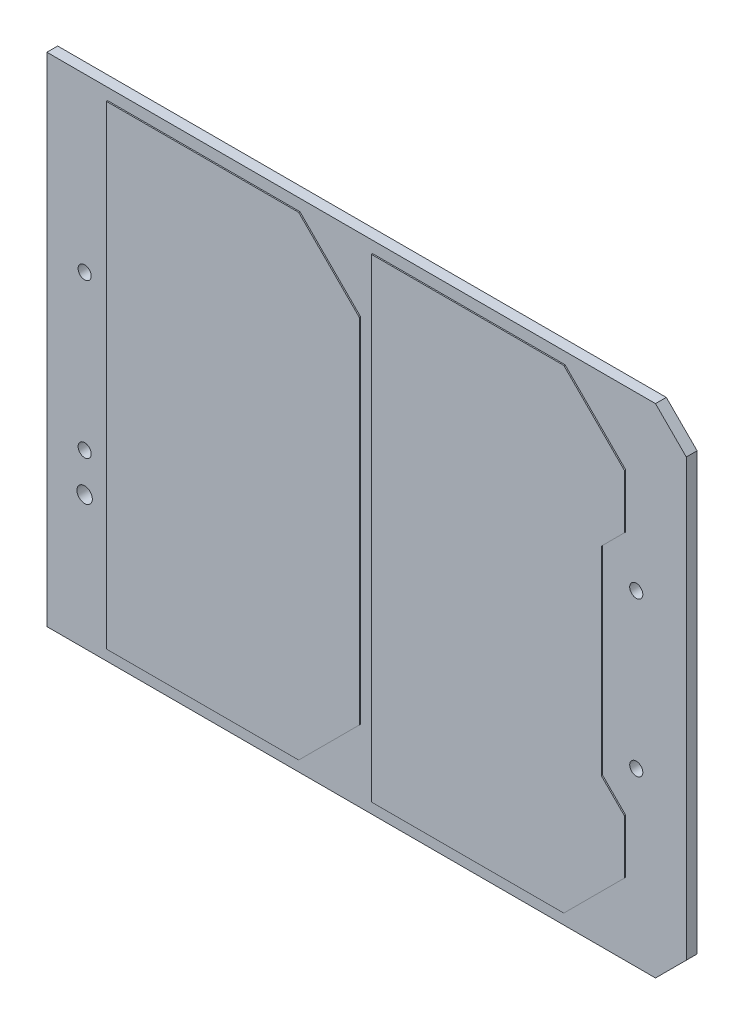
ISO-10303-21;
HEADER;
FILE_DESCRIPTION(('STEP AP214'),'2;1');
FILE_NAME('part.step','',(''),(''),'','','');
FILE_SCHEMA(('AUTOMOTIVE_DESIGN { 1 0 10303 214 1 1 1 1 }'));
ENDSEC;
DATA;
#1=APPLICATION_CONTEXT('core data for automotive mechanical design processes');
#2=APPLICATION_PROTOCOL_DEFINITION('international standard','automotive_design',2000,#1);
#3=PRODUCT_CONTEXT('',#1,'mechanical');
#4=PRODUCT('Part','Part','',(#3));
#5=PRODUCT_RELATED_PRODUCT_CATEGORY('part','',(#4));
#6=PRODUCT_DEFINITION_FORMATION('','',#4);
#7=PRODUCT_DEFINITION_CONTEXT('part definition',#1,'design');
#8=PRODUCT_DEFINITION('design','',#6,#7);
#9=PRODUCT_DEFINITION_SHAPE('','',#8);
#10=(LENGTH_UNIT() NAMED_UNIT(*) SI_UNIT(.MILLI.,.METRE.));
#11=(NAMED_UNIT(*) PLANE_ANGLE_UNIT() SI_UNIT($,.RADIAN.));
#12=(NAMED_UNIT(*) SI_UNIT($,.STERADIAN.) SOLID_ANGLE_UNIT());
#13=UNCERTAINTY_MEASURE_WITH_UNIT(LENGTH_MEASURE(1.E-05),#10,'distance_accuracy_value','');
#14=(GEOMETRIC_REPRESENTATION_CONTEXT(3) GLOBAL_UNCERTAINTY_ASSIGNED_CONTEXT((#13)) GLOBAL_UNIT_ASSIGNED_CONTEXT((#10,
#11,#12)) REPRESENTATION_CONTEXT('',''));
#15=CARTESIAN_POINT('',(0.,0.,0.));
#16=DIRECTION('',(0.,0.,1.));
#17=DIRECTION('',(1.,0.,0.));
#18=AXIS2_PLACEMENT_3D('',#15,#16,#17);
#19=CARTESIAN_POINT('',(0.,0.,1.778));
#20=DIRECTION('',(0.,0.,1.));
#21=DIRECTION('',(1.,0.,0.));
#22=AXIS2_PLACEMENT_3D('',#19,#20,#21);
#23=PLANE('',#22);
#24=CARTESIAN_POINT('',(-46.482,-19.05,1.778));
#25=DIRECTION('',(0.,0.,1.));
#26=DIRECTION('',(1.,0.,0.));
#27=AXIS2_PLACEMENT_3D('',#24,#25,#26);
#28=CIRCLE('',#27,1.27);
#29=CARTESIAN_POINT('',(-45.212,-19.05,1.778));
#30=VERTEX_POINT('',#29);
#31=EDGE_CURVE('E296',#30,#30,#28,.T.);
#32=ORIENTED_EDGE('',*,*,#31,.F.);
#33=EDGE_LOOP('',(#32));
#34=FACE_BOUND('',#33,.T.);
#35=CARTESIAN_POINT('',(-46.482,-12.7,1.778));
#36=DIRECTION('',(0.,0.,1.));
#37=DIRECTION('',(1.,0.,0.));
#38=AXIS2_PLACEMENT_3D('',#35,#36,#37);
#39=CIRCLE('',#38,1.0795);
#40=CARTESIAN_POINT('',(-45.4025,-12.7,1.778));
#41=VERTEX_POINT('',#40);
#42=EDGE_CURVE('E300',#41,#41,#39,.T.);
#43=ORIENTED_EDGE('',*,*,#42,.F.);
#44=EDGE_LOOP('',(#43));
#45=FACE_BOUND('',#44,.T.);
#46=CARTESIAN_POINT('',(-46.482,12.7,1.778));
#47=DIRECTION('',(0.,0.,1.));
#48=DIRECTION('',(1.,0.,0.));
#49=AXIS2_PLACEMENT_3D('',#46,#47,#48);
#50=CIRCLE('',#49,1.0795);
#51=CARTESIAN_POINT('',(-45.4025,12.7,1.778));
#52=VERTEX_POINT('',#51);
#53=EDGE_CURVE('E305',#52,#52,#50,.T.);
#54=ORIENTED_EDGE('',*,*,#53,.F.);
#55=EDGE_LOOP('',(#54));
#56=FACE_BOUND('',#55,.T.);
#57=CARTESIAN_POINT('',(44.45,-12.7,1.778));
#58=DIRECTION('',(0.,0.,1.));
#59=DIRECTION('',(1.,0.,0.));
#60=AXIS2_PLACEMENT_3D('',#57,#58,#59);
#61=CIRCLE('',#60,1.0795);
#62=CARTESIAN_POINT('',(45.5295,-12.7,1.778));
#63=VERTEX_POINT('',#62);
#64=EDGE_CURVE('E309',#63,#63,#61,.T.);
#65=ORIENTED_EDGE('',*,*,#64,.F.);
#66=EDGE_LOOP('',(#65));
#67=FACE_BOUND('',#66,.T.);
#68=CARTESIAN_POINT('',(44.45,12.7,1.778));
#69=DIRECTION('',(0.,0.,1.));
#70=DIRECTION('',(1.,0.,0.));
#71=AXIS2_PLACEMENT_3D('',#68,#69,#70);
#72=CIRCLE('',#71,1.0795);
#73=CARTESIAN_POINT('',(45.5295,12.7,1.778));
#74=VERTEX_POINT('',#73);
#75=EDGE_CURVE('E313',#74,#74,#72,.T.);
#76=ORIENTED_EDGE('',*,*,#75,.F.);
#77=EDGE_LOOP('',(#76));
#78=FACE_BOUND('',#77,.T.);
#79=DIRECTION('',(1.,0.,0.));
#80=VECTOR('',#79,1.);
#81=CARTESIAN_POINT('',(0.,-41.,1.778));
#82=LINE('',#81,#80);
#83=CARTESIAN_POINT('',(-52.705,-41.,1.778));
#84=VERTEX_POINT('',#83);
#85=CARTESIAN_POINT('',(47.625,-41.,1.778));
#86=VERTEX_POINT('',#85);
#87=EDGE_CURVE('E317',#84,#86,#82,.T.);
#88=ORIENTED_EDGE('',*,*,#87,.T.);
#89=DIRECTION('',(-0.707106781186549,-0.707106781186546,0.));
#90=VECTOR('',#89,1.);
#91=CARTESIAN_POINT('',(44.3124999999999,-44.3125000000001,1.778));
#92=LINE('',#91,#90);
#93=CARTESIAN_POINT('',(52.705,-35.92,1.778));
#94=VERTEX_POINT('',#93);
#95=EDGE_CURVE('E55',#86,#94,#92,.F.);
#96=ORIENTED_EDGE('',*,*,#95,.T.);
#97=DIRECTION('',(0.,1.,0.));
#98=VECTOR('',#97,1.);
#99=CARTESIAN_POINT('',(52.705,0.,1.778));
#100=LINE('',#99,#98);
#101=CARTESIAN_POINT('',(52.705,35.92,1.778));
#102=VERTEX_POINT('',#101);
#103=EDGE_CURVE('E320',#94,#102,#100,.T.);
#104=ORIENTED_EDGE('',*,*,#103,.T.);
#105=DIRECTION('',(-0.707106781186546,0.707106781186549,0.));
#106=VECTOR('',#105,1.);
#107=CARTESIAN_POINT('',(44.3125000000001,44.3124999999999,1.778));
#108=LINE('',#107,#106);
#109=CARTESIAN_POINT('',(47.625,41.,1.778));
#110=VERTEX_POINT('',#109);
#111=EDGE_CURVE('E62',#102,#110,#108,.T.);
#112=ORIENTED_EDGE('',*,*,#111,.T.);
#113=DIRECTION('',(1.,0.,0.));
#114=VECTOR('',#113,1.);
#115=CARTESIAN_POINT('',(0.,41.,1.778));
#116=LINE('',#115,#114);
#117=CARTESIAN_POINT('',(-52.705,41.,1.778));
#118=VERTEX_POINT('',#117);
#119=EDGE_CURVE('E323',#118,#110,#116,.T.);
#120=ORIENTED_EDGE('',*,*,#119,.F.);
#121=DIRECTION('',(0.,1.,0.));
#122=VECTOR('',#121,1.);
#123=CARTESIAN_POINT('',(-52.705,0.,1.778));
#124=LINE('',#123,#122);
#125=EDGE_CURVE('E326',#84,#118,#124,.T.);
#126=ORIENTED_EDGE('',*,*,#125,.F.);
#127=EDGE_LOOP('',(#88,#96,#104,#112,#120,#126));
#128=FACE_BOUND('',#127,.T.);
#129=DIRECTION('',(1.,0.,0.));
#130=VECTOR('',#129,1.);
#131=CARTESIAN_POINT('',(-42.705,-39.095,1.778));
#132=LINE('',#131,#130);
#133=CARTESIAN_POINT('',(-42.705,-39.095,1.778));
#134=VERTEX_POINT('',#133);
#135=CARTESIAN_POINT('',(-11.,-39.095,1.778));
#136=VERTEX_POINT('',#135);
#137=EDGE_CURVE('E233',#134,#136,#132,.T.);
#138=ORIENTED_EDGE('',*,*,#137,.F.);
#139=DIRECTION('',(0.,-1.,0.));
#140=VECTOR('',#139,1.);
#141=CARTESIAN_POINT('',(-42.705,39.095,1.778));
#142=LINE('',#141,#140);
#143=CARTESIAN_POINT('',(-42.705,39.095,1.778));
#144=VERTEX_POINT('',#143);
#145=EDGE_CURVE('E228',#144,#134,#142,.T.);
#146=ORIENTED_EDGE('',*,*,#145,.F.);
#147=DIRECTION('',(-1.,0.,0.));
#148=VECTOR('',#147,1.);
#149=CARTESIAN_POINT('',(-42.705,39.095,1.778));
#150=LINE('',#149,#148);
#151=CARTESIAN_POINT('',(-11.,39.095,1.778));
#152=VERTEX_POINT('',#151);
#153=EDGE_CURVE('E244',#152,#144,#150,.T.);
#154=ORIENTED_EDGE('',*,*,#153,.F.);
#155=DIRECTION('',(-0.707106781186547,0.707106781186548,0.));
#156=VECTOR('',#155,1.);
#157=CARTESIAN_POINT('',(-11.,39.095,1.778));
#158=LINE('',#157,#156);
#159=CARTESIAN_POINT('',(-1.00000000000004,29.095,1.778));
#160=VERTEX_POINT('',#159);
#161=EDGE_CURVE('E268',#160,#152,#158,.T.);
#162=ORIENTED_EDGE('',*,*,#161,.F.);
#163=DIRECTION('',(0.,1.,0.));
#164=VECTOR('',#163,1.);
#165=CARTESIAN_POINT('',(-1.00000000000004,29.095,1.778));
#166=LINE('',#165,#164);
#167=CARTESIAN_POINT('',(-0.999999999999987,-29.095,1.778));
#168=VERTEX_POINT('',#167);
#169=EDGE_CURVE('E265',#168,#160,#166,.T.);
#170=ORIENTED_EDGE('',*,*,#169,.F.);
#171=DIRECTION('',(0.707106781186547,0.707106781186548,0.));
#172=VECTOR('',#171,1.);
#173=CARTESIAN_POINT('',(-0.999999999999987,-29.095,1.778));
#174=LINE('',#173,#172);
#175=EDGE_CURVE('E262',#136,#168,#174,.T.);
#176=ORIENTED_EDGE('',*,*,#175,.F.);
#177=EDGE_LOOP('',(#138,#146,#154,#162,#170,#176));
#178=FACE_BOUND('',#177,.T.);
#179=DIRECTION('',(-0.707106781186547,0.707106781186547,0.));
#180=VECTOR('',#179,1.);
#181=CARTESIAN_POINT('',(32.705,39.095,1.778));
#182=LINE('',#181,#180);
#183=CARTESIAN_POINT('',(42.705,29.095,1.778));
#184=VERTEX_POINT('',#183);
#185=CARTESIAN_POINT('',(32.705,39.095,1.778));
#186=VERTEX_POINT('',#185);
#187=EDGE_CURVE('E731',#184,#186,#182,.T.);
#188=ORIENTED_EDGE('',*,*,#187,.F.);
#189=DIRECTION('',(0.,1.,0.));
#190=VECTOR('',#189,1.);
#191=CARTESIAN_POINT('',(42.705,29.095,1.778));
#192=LINE('',#191,#190);
#193=CARTESIAN_POINT('',(42.705,20.205,1.778));
#194=VERTEX_POINT('',#193);
#195=EDGE_CURVE('E225',#194,#184,#192,.T.);
#196=ORIENTED_EDGE('',*,*,#195,.F.);
#197=DIRECTION('',(0.707106781186549,0.707106781186546,0.));
#198=VECTOR('',#197,1.);
#199=CARTESIAN_POINT('',(42.705,20.205,1.778));
#200=LINE('',#199,#198);
#201=CARTESIAN_POINT('',(38.895,16.395,1.778));
#202=VERTEX_POINT('',#201);
#203=EDGE_CURVE('E221',#202,#194,#200,.T.);
#204=ORIENTED_EDGE('',*,*,#203,.F.);
#205=DIRECTION('',(0.,1.,0.));
#206=VECTOR('',#205,1.);
#207=CARTESIAN_POINT('',(38.895,16.395,1.778));
#208=LINE('',#207,#206);
#209=CARTESIAN_POINT('',(38.895,-16.395,1.778));
#210=VERTEX_POINT('',#209);
#211=EDGE_CURVE('E726',#210,#202,#208,.T.);
#212=ORIENTED_EDGE('',*,*,#211,.F.);
#213=DIRECTION('',(-0.707106781186548,0.707106781186547,0.));
#214=VECTOR('',#213,1.);
#215=CARTESIAN_POINT('',(38.895,-16.395,1.778));
#216=LINE('',#215,#214);
#217=CARTESIAN_POINT('',(42.705,-20.205,1.778));
#218=VERTEX_POINT('',#217);
#219=EDGE_CURVE('E754',#218,#210,#216,.T.);
#220=ORIENTED_EDGE('',*,*,#219,.F.);
#221=DIRECTION('',(0.,1.,0.));
#222=VECTOR('',#221,1.);
#223=CARTESIAN_POINT('',(42.705,-20.205,1.778));
#224=LINE('',#223,#222);
#225=CARTESIAN_POINT('',(42.705,-29.095,1.778));
#226=VERTEX_POINT('',#225);
#227=EDGE_CURVE('E751',#226,#218,#224,.T.);
#228=ORIENTED_EDGE('',*,*,#227,.F.);
#229=DIRECTION('',(0.707106781186547,0.707106781186548,0.));
#230=VECTOR('',#229,1.);
#231=CARTESIAN_POINT('',(32.705,-39.095,1.778));
#232=LINE('',#231,#230);
#233=CARTESIAN_POINT('',(32.705,-39.095,1.778));
#234=VERTEX_POINT('',#233);
#235=EDGE_CURVE('E748',#234,#226,#232,.T.);
#236=ORIENTED_EDGE('',*,*,#235,.F.);
#237=DIRECTION('',(1.,0.,0.));
#238=VECTOR('',#237,1.);
#239=CARTESIAN_POINT('',(1.00000000000001,-39.095,1.778));
#240=LINE('',#239,#238);
#241=CARTESIAN_POINT('',(1.00000000000001,-39.095,1.778));
#242=VERTEX_POINT('',#241);
#243=EDGE_CURVE('E745',#242,#234,#240,.T.);
#244=ORIENTED_EDGE('',*,*,#243,.F.);
#245=DIRECTION('',(0.,-1.,0.));
#246=VECTOR('',#245,1.);
#247=CARTESIAN_POINT('',(0.999999999999956,39.095,1.778));
#248=LINE('',#247,#246);
#249=CARTESIAN_POINT('',(0.999999999999956,39.095,1.778));
#250=VERTEX_POINT('',#249);
#251=EDGE_CURVE('E742',#250,#242,#248,.T.);
#252=ORIENTED_EDGE('',*,*,#251,.F.);
#253=DIRECTION('',(-1.,0.,0.));
#254=VECTOR('',#253,1.);
#255=CARTESIAN_POINT('',(0.999999999999956,39.095,1.778));
#256=LINE('',#255,#254);
#257=EDGE_CURVE('E735',#186,#250,#256,.T.);
#258=ORIENTED_EDGE('',*,*,#257,.F.);
#259=EDGE_LOOP('',(#188,#196,#204,#212,#220,#228,#236,#244,#252,#258));
#260=FACE_BOUND('',#259,.T.);
#261=ADVANCED_FACE('F45',(#34,#45,#56,#67,#78,#128,#178,#260),#23,.T.);
#262=CARTESIAN_POINT('',(0.,-41.,1.778));
#263=DIRECTION('',(0.,1.,0.));
#264=DIRECTION('',(0.,0.,1.));
#265=AXIS2_PLACEMENT_3D('',#262,#263,#264);
#266=PLANE('',#265);
#267=DIRECTION('',(1.,0.,0.));
#268=VECTOR('',#267,1.);
#269=CARTESIAN_POINT('',(0.,-41.,0.));
#270=LINE('',#269,#268);
#271=CARTESIAN_POINT('',(-52.705,-41.,0.));
#272=VERTEX_POINT('',#271);
#273=CARTESIAN_POINT('',(47.625,-41.,0.));
#274=VERTEX_POINT('',#273);
#275=EDGE_CURVE('E350',#272,#274,#270,.T.);
#276=ORIENTED_EDGE('',*,*,#275,.T.);
#277=DIRECTION('',(0.,0.,1.));
#278=VECTOR('',#277,1.);
#279=CARTESIAN_POINT('',(47.625,-41.,1.778));
#280=LINE('',#279,#278);
#281=EDGE_CURVE('E70',#274,#86,#280,.T.);
#282=ORIENTED_EDGE('',*,*,#281,.T.);
#283=ORIENTED_EDGE('',*,*,#87,.F.);
#284=DIRECTION('',(0.,0.,-1.));
#285=VECTOR('',#284,1.);
#286=CARTESIAN_POINT('',(-52.705,-41.,1.778));
#287=LINE('',#286,#285);
#288=EDGE_CURVE('E330',#84,#272,#287,.T.);
#289=ORIENTED_EDGE('',*,*,#288,.T.);
#290=EDGE_LOOP('',(#276,#282,#283,#289));
#291=FACE_BOUND('',#290,.T.);
#292=ADVANCED_FACE('F401',(#291),#266,.F.);
#293=CARTESIAN_POINT('',(52.705,0.,1.778));
#294=DIRECTION('',(-1.,0.,0.));
#295=DIRECTION('',(0.,0.,1.));
#296=AXIS2_PLACEMENT_3D('',#293,#294,#295);
#297=PLANE('',#296);
#298=ORIENTED_EDGE('',*,*,#103,.F.);
#299=DIRECTION('',(0.,0.,-1.));
#300=VECTOR('',#299,1.);
#301=CARTESIAN_POINT('',(52.705,-35.92,1.778));
#302=LINE('',#301,#300);
#303=CARTESIAN_POINT('',(52.705,-35.92,0.));
#304=VERTEX_POINT('',#303);
#305=EDGE_CURVE('E372',#94,#304,#302,.T.);
#306=ORIENTED_EDGE('',*,*,#305,.T.);
#307=DIRECTION('',(0.,1.,0.));
#308=VECTOR('',#307,1.);
#309=CARTESIAN_POINT('',(52.705,0.,0.));
#310=LINE('',#309,#308);
#311=CARTESIAN_POINT('',(52.705,35.92,0.));
#312=VERTEX_POINT('',#311);
#313=EDGE_CURVE('E353',#304,#312,#310,.T.);
#314=ORIENTED_EDGE('',*,*,#313,.T.);
#315=DIRECTION('',(0.,0.,1.));
#316=VECTOR('',#315,1.);
#317=CARTESIAN_POINT('',(52.705,35.92,1.778));
#318=LINE('',#317,#316);
#319=EDGE_CURVE('E369',#312,#102,#318,.T.);
#320=ORIENTED_EDGE('',*,*,#319,.T.);
#321=EDGE_LOOP('',(#298,#306,#314,#320));
#322=FACE_BOUND('',#321,.T.);
#323=ADVANCED_FACE('F393',(#322),#297,.F.);
#324=CARTESIAN_POINT('',(0.,41.,1.778));
#325=DIRECTION('',(0.,1.,0.));
#326=DIRECTION('',(0.,0.,1.));
#327=AXIS2_PLACEMENT_3D('',#324,#325,#326);
#328=PLANE('',#327);
#329=ORIENTED_EDGE('',*,*,#119,.T.);
#330=DIRECTION('',(0.,0.,-1.));
#331=VECTOR('',#330,1.);
#332=CARTESIAN_POINT('',(47.625,41.,0.));
#333=LINE('',#332,#331);
#334=CARTESIAN_POINT('',(47.625,41.,0.));
#335=VERTEX_POINT('',#334);
#336=EDGE_CURVE('E11',#110,#335,#333,.T.);
#337=ORIENTED_EDGE('',*,*,#336,.T.);
#338=DIRECTION('',(1.,0.,0.));
#339=VECTOR('',#338,1.);
#340=CARTESIAN_POINT('',(0.,41.,0.));
#341=LINE('',#340,#339);
#342=CARTESIAN_POINT('',(-52.705,41.,0.));
#343=VERTEX_POINT('',#342);
#344=EDGE_CURVE('E357',#343,#335,#341,.T.);
#345=ORIENTED_EDGE('',*,*,#344,.F.);
#346=DIRECTION('',(0.,0.,-1.));
#347=VECTOR('',#346,1.);
#348=CARTESIAN_POINT('',(-52.705,41.,1.778));
#349=LINE('',#348,#347);
#350=EDGE_CURVE('E366',#118,#343,#349,.T.);
#351=ORIENTED_EDGE('',*,*,#350,.F.);
#352=EDGE_LOOP('',(#329,#337,#345,#351));
#353=FACE_BOUND('',#352,.T.);
#354=ADVANCED_FACE('F406',(#353),#328,.T.);
#355=CARTESIAN_POINT('',(44.45,12.7,1.778));
#356=DIRECTION('',(0.,0.,-1.));
#357=DIRECTION('',(-1.,0.,0.));
#358=AXIS2_PLACEMENT_3D('',#355,#356,#357);
#359=CYLINDRICAL_SURFACE('',#358,1.0795);
#360=ORIENTED_EDGE('',*,*,#75,.T.);
#361=EDGE_LOOP('',(#360));
#362=FACE_BOUND('',#361,.T.);
#363=CARTESIAN_POINT('',(44.45,12.7,0.));
#364=DIRECTION('',(0.,0.,1.));
#365=DIRECTION('',(1.,0.,0.));
#366=AXIS2_PLACEMENT_3D('',#363,#364,#365);
#367=CIRCLE('',#366,1.0795);
#368=CARTESIAN_POINT('',(45.5295,12.7,0.));
#369=VERTEX_POINT('',#368);
#370=EDGE_CURVE('E346',#369,#369,#367,.T.);
#371=ORIENTED_EDGE('',*,*,#370,.F.);
#372=EDGE_LOOP('',(#371));
#373=FACE_BOUND('',#372,.T.);
#374=ADVANCED_FACE('F434',(#362,#373),#359,.F.);
#375=CARTESIAN_POINT('',(44.45,-12.7,1.778));
#376=DIRECTION('',(0.,0.,-1.));
#377=DIRECTION('',(-1.,0.,0.));
#378=AXIS2_PLACEMENT_3D('',#375,#376,#377);
#379=CYLINDRICAL_SURFACE('',#378,1.0795);
#380=ORIENTED_EDGE('',*,*,#64,.T.);
#381=EDGE_LOOP('',(#380));
#382=FACE_BOUND('',#381,.T.);
#383=CARTESIAN_POINT('',(44.45,-12.7,0.));
#384=DIRECTION('',(0.,0.,1.));
#385=DIRECTION('',(1.,0.,0.));
#386=AXIS2_PLACEMENT_3D('',#383,#384,#385);
#387=CIRCLE('',#386,1.0795);
#388=CARTESIAN_POINT('',(45.5295,-12.7,0.));
#389=VERTEX_POINT('',#388);
#390=EDGE_CURVE('E342',#389,#389,#387,.T.);
#391=ORIENTED_EDGE('',*,*,#390,.F.);
#392=EDGE_LOOP('',(#391));
#393=FACE_BOUND('',#392,.T.);
#394=ADVANCED_FACE('F439',(#382,#393),#379,.F.);
#395=CARTESIAN_POINT('',(-46.482,12.7,1.778));
#396=DIRECTION('',(0.,0.,-1.));
#397=DIRECTION('',(-1.,0.,0.));
#398=AXIS2_PLACEMENT_3D('',#395,#396,#397);
#399=CYLINDRICAL_SURFACE('',#398,1.0795);
#400=ORIENTED_EDGE('',*,*,#53,.T.);
#401=EDGE_LOOP('',(#400));
#402=FACE_BOUND('',#401,.T.);
#403=CARTESIAN_POINT('',(-46.482,12.7,0.));
#404=DIRECTION('',(0.,0.,1.));
#405=DIRECTION('',(1.,0.,0.));
#406=AXIS2_PLACEMENT_3D('',#403,#404,#405);
#407=CIRCLE('',#406,1.0795);
#408=CARTESIAN_POINT('',(-45.4025,12.7,0.));
#409=VERTEX_POINT('',#408);
#410=EDGE_CURVE('E338',#409,#409,#407,.T.);
#411=ORIENTED_EDGE('',*,*,#410,.F.);
#412=EDGE_LOOP('',(#411));
#413=FACE_BOUND('',#412,.T.);
#414=ADVANCED_FACE('F443',(#402,#413),#399,.F.);
#415=CARTESIAN_POINT('',(-46.482,-12.7,1.778));
#416=DIRECTION('',(0.,0.,-1.));
#417=DIRECTION('',(-1.,0.,0.));
#418=AXIS2_PLACEMENT_3D('',#415,#416,#417);
#419=CYLINDRICAL_SURFACE('',#418,1.0795);
#420=ORIENTED_EDGE('',*,*,#42,.T.);
#421=EDGE_LOOP('',(#420));
#422=FACE_BOUND('',#421,.T.);
#423=CARTESIAN_POINT('',(-46.482,-12.7,0.));
#424=DIRECTION('',(0.,0.,1.));
#425=DIRECTION('',(1.,0.,0.));
#426=AXIS2_PLACEMENT_3D('',#423,#424,#425);
#427=CIRCLE('',#426,1.0795);
#428=CARTESIAN_POINT('',(-45.4025,-12.7,0.));
#429=VERTEX_POINT('',#428);
#430=EDGE_CURVE('E334',#429,#429,#427,.T.);
#431=ORIENTED_EDGE('',*,*,#430,.F.);
#432=EDGE_LOOP('',(#431));
#433=FACE_BOUND('',#432,.T.);
#434=ADVANCED_FACE('F447',(#422,#433),#419,.F.);
#435=CARTESIAN_POINT('',(-46.482,-19.05,1.778));
#436=DIRECTION('',(0.,0.,-1.));
#437=DIRECTION('',(-1.,0.,0.));
#438=AXIS2_PLACEMENT_3D('',#435,#436,#437);
#439=CYLINDRICAL_SURFACE('',#438,1.27);
#440=ORIENTED_EDGE('',*,*,#31,.T.);
#441=EDGE_LOOP('',(#440));
#442=FACE_BOUND('',#441,.T.);
#443=CARTESIAN_POINT('',(-46.482,-19.05,0.));
#444=DIRECTION('',(0.,0.,1.));
#445=DIRECTION('',(1.,0.,0.));
#446=AXIS2_PLACEMENT_3D('',#443,#444,#445);
#447=CIRCLE('',#446,1.27);
#448=CARTESIAN_POINT('',(-45.212,-19.05,0.));
#449=VERTEX_POINT('',#448);
#450=EDGE_CURVE('E295',#449,#449,#447,.T.);
#451=ORIENTED_EDGE('',*,*,#450,.F.);
#452=EDGE_LOOP('',(#451));
#453=FACE_BOUND('',#452,.T.);
#454=ADVANCED_FACE('F431',(#442,#453),#439,.F.);
#455=CARTESIAN_POINT('',(-52.705,0.,1.778));
#456=DIRECTION('',(-1.,0.,0.));
#457=DIRECTION('',(0.,0.,1.));
#458=AXIS2_PLACEMENT_3D('',#455,#456,#457);
#459=PLANE('',#458);
#460=DIRECTION('',(0.,1.,0.));
#461=VECTOR('',#460,1.);
#462=CARTESIAN_POINT('',(-52.705,0.,0.));
#463=LINE('',#462,#461);
#464=EDGE_CURVE('E301',#272,#343,#463,.T.);
#465=ORIENTED_EDGE('',*,*,#464,.F.);
#466=ORIENTED_EDGE('',*,*,#288,.F.);
#467=ORIENTED_EDGE('',*,*,#125,.T.);
#468=ORIENTED_EDGE('',*,*,#350,.T.);
#469=EDGE_LOOP('',(#465,#466,#467,#468));
#470=FACE_BOUND('',#469,.T.);
#471=ADVANCED_FACE('F403',(#470),#459,.T.);
#472=CARTESIAN_POINT('',(0.,0.,0.));
#473=DIRECTION('',(0.,0.,1.));
#474=DIRECTION('',(1.,0.,0.));
#475=AXIS2_PLACEMENT_3D('',#472,#473,#474);
#476=PLANE('',#475);
#477=ORIENTED_EDGE('',*,*,#450,.T.);
#478=EDGE_LOOP('',(#477));
#479=FACE_BOUND('',#478,.T.);
#480=ORIENTED_EDGE('',*,*,#430,.T.);
#481=EDGE_LOOP('',(#480));
#482=FACE_BOUND('',#481,.T.);
#483=ORIENTED_EDGE('',*,*,#410,.T.);
#484=EDGE_LOOP('',(#483));
#485=FACE_BOUND('',#484,.T.);
#486=ORIENTED_EDGE('',*,*,#390,.T.);
#487=EDGE_LOOP('',(#486));
#488=FACE_BOUND('',#487,.T.);
#489=ORIENTED_EDGE('',*,*,#370,.T.);
#490=EDGE_LOOP('',(#489));
#491=FACE_BOUND('',#490,.T.);
#492=ORIENTED_EDGE('',*,*,#313,.F.);
#493=DIRECTION('',(0.707106781186549,0.707106781186546,0.));
#494=VECTOR('',#493,1.);
#495=CARTESIAN_POINT('',(52.705,-35.92,0.));
#496=LINE('',#495,#494);
#497=EDGE_CURVE('E379',#304,#274,#496,.F.);
#498=ORIENTED_EDGE('',*,*,#497,.T.);
#499=ORIENTED_EDGE('',*,*,#275,.F.);
#500=ORIENTED_EDGE('',*,*,#464,.T.);
#501=ORIENTED_EDGE('',*,*,#344,.T.);
#502=DIRECTION('',(0.707106781186546,-0.707106781186549,0.));
#503=VECTOR('',#502,1.);
#504=CARTESIAN_POINT('',(47.625,41.,0.));
#505=LINE('',#504,#503);
#506=EDGE_CURVE('E376',#335,#312,#505,.T.);
#507=ORIENTED_EDGE('',*,*,#506,.T.);
#508=EDGE_LOOP('',(#492,#498,#499,#500,#501,#507));
#509=FACE_BOUND('',#508,.T.);
#510=ADVANCED_FACE('F399',(#479,#482,#485,#488,#491,#509),#476,.F.);
#511=CARTESIAN_POINT('',(-42.705,39.095,1.978));
#512=DIRECTION('',(1.,0.,0.));
#513=DIRECTION('',(0.,0.,-1.));
#514=AXIS2_PLACEMENT_3D('',#511,#512,#513);
#515=PLANE('',#514);
#516=ORIENTED_EDGE('',*,*,#145,.T.);
#517=DIRECTION('',(0.,0.,-1.));
#518=VECTOR('',#517,1.);
#519=CARTESIAN_POINT('',(-42.705,-39.095,1.978));
#520=LINE('',#519,#518);
#521=CARTESIAN_POINT('',(-42.705,-39.095,1.978));
#522=VERTEX_POINT('',#521);
#523=EDGE_CURVE('E292',#522,#134,#520,.T.);
#524=ORIENTED_EDGE('',*,*,#523,.F.);
#525=DIRECTION('',(0.,-1.,0.));
#526=VECTOR('',#525,1.);
#527=CARTESIAN_POINT('',(-42.705,39.095,1.978));
#528=LINE('',#527,#526);
#529=CARTESIAN_POINT('',(-42.705,39.095,1.978));
#530=VERTEX_POINT('',#529);
#531=EDGE_CURVE('E239',#530,#522,#528,.T.);
#532=ORIENTED_EDGE('',*,*,#531,.F.);
#533=DIRECTION('',(0.,0.,-1.));
#534=VECTOR('',#533,1.);
#535=CARTESIAN_POINT('',(-42.705,39.095,1.978));
#536=LINE('',#535,#534);
#537=EDGE_CURVE('E258',#530,#144,#536,.T.);
#538=ORIENTED_EDGE('',*,*,#537,.T.);
#539=EDGE_LOOP('',(#516,#524,#532,#538));
#540=FACE_BOUND('',#539,.T.);
#541=ADVANCED_FACE('F424',(#540),#515,.F.);
#542=CARTESIAN_POINT('',(-42.705,-39.095,1.978));
#543=DIRECTION('',(0.,1.,0.));
#544=DIRECTION('',(0.,0.,1.));
#545=AXIS2_PLACEMENT_3D('',#542,#543,#544);
#546=PLANE('',#545);
#547=ORIENTED_EDGE('',*,*,#137,.T.);
#548=DIRECTION('',(0.,0.,-1.));
#549=VECTOR('',#548,1.);
#550=CARTESIAN_POINT('',(-11.,-39.095,1.978));
#551=LINE('',#550,#549);
#552=CARTESIAN_POINT('',(-11.,-39.095,1.978));
#553=VERTEX_POINT('',#552);
#554=EDGE_CURVE('E288',#553,#136,#551,.T.);
#555=ORIENTED_EDGE('',*,*,#554,.F.);
#556=DIRECTION('',(1.,0.,0.));
#557=VECTOR('',#556,1.);
#558=CARTESIAN_POINT('',(-42.705,-39.095,1.978));
#559=LINE('',#558,#557);
#560=EDGE_CURVE('E243',#522,#553,#559,.T.);
#561=ORIENTED_EDGE('',*,*,#560,.F.);
#562=ORIENTED_EDGE('',*,*,#523,.T.);
#563=EDGE_LOOP('',(#547,#555,#561,#562));
#564=FACE_BOUND('',#563,.T.);
#565=ADVANCED_FACE('F493',(#564),#546,.F.);
#566=CARTESIAN_POINT('',(-0.999999999999987,-29.095,1.978));
#567=DIRECTION('',(-0.707106781186548,0.707106781186548,0.));
#568=DIRECTION('',(-0.707106781186548,-0.707106781186548,0.));
#569=AXIS2_PLACEMENT_3D('',#566,#567,#568);
#570=PLANE('',#569);
#571=ORIENTED_EDGE('',*,*,#175,.T.);
#572=DIRECTION('',(0.,0.,-1.));
#573=VECTOR('',#572,1.);
#574=CARTESIAN_POINT('',(-0.999999999999987,-29.095,1.978));
#575=LINE('',#574,#573);
#576=CARTESIAN_POINT('',(-0.999999999999987,-29.095,1.978));
#577=VERTEX_POINT('',#576);
#578=EDGE_CURVE('E284',#577,#168,#575,.T.);
#579=ORIENTED_EDGE('',*,*,#578,.F.);
#580=DIRECTION('',(0.707106781186547,0.707106781186548,0.));
#581=VECTOR('',#580,1.);
#582=CARTESIAN_POINT('',(-0.999999999999987,-29.095,1.978));
#583=LINE('',#582,#581);
#584=EDGE_CURVE('E247',#553,#577,#583,.T.);
#585=ORIENTED_EDGE('',*,*,#584,.F.);
#586=ORIENTED_EDGE('',*,*,#554,.T.);
#587=EDGE_LOOP('',(#571,#579,#585,#586));
#588=FACE_BOUND('',#587,.T.);
#589=ADVANCED_FACE('F500',(#588),#570,.F.);
#590=CARTESIAN_POINT('',(-1.00000000000004,29.095,1.978));
#591=DIRECTION('',(-1.,0.,0.));
#592=DIRECTION('',(0.,-1.,0.));
#593=AXIS2_PLACEMENT_3D('',#590,#591,#592);
#594=PLANE('',#593);
#595=ORIENTED_EDGE('',*,*,#169,.T.);
#596=DIRECTION('',(0.,0.,-1.));
#597=VECTOR('',#596,1.);
#598=CARTESIAN_POINT('',(-1.00000000000004,29.095,1.978));
#599=LINE('',#598,#597);
#600=CARTESIAN_POINT('',(-1.00000000000004,29.095,1.978));
#601=VERTEX_POINT('',#600);
#602=EDGE_CURVE('E280',#601,#160,#599,.T.);
#603=ORIENTED_EDGE('',*,*,#602,.F.);
#604=DIRECTION('',(0.,1.,0.));
#605=VECTOR('',#604,1.);
#606=CARTESIAN_POINT('',(-1.00000000000004,29.095,1.978));
#607=LINE('',#606,#605);
#608=EDGE_CURVE('E250',#577,#601,#607,.T.);
#609=ORIENTED_EDGE('',*,*,#608,.F.);
#610=ORIENTED_EDGE('',*,*,#578,.T.);
#611=EDGE_LOOP('',(#595,#603,#609,#610));
#612=FACE_BOUND('',#611,.T.);
#613=ADVANCED_FACE('F507',(#612),#594,.F.);
#614=CARTESIAN_POINT('',(-11.,39.095,1.978));
#615=DIRECTION('',(-0.707106781186548,-0.707106781186548,0.));
#616=DIRECTION('',(0.707106781186548,-0.707106781186548,0.));
#617=AXIS2_PLACEMENT_3D('',#614,#615,#616);
#618=PLANE('',#617);
#619=ORIENTED_EDGE('',*,*,#161,.T.);
#620=DIRECTION('',(0.,0.,-1.));
#621=VECTOR('',#620,1.);
#622=CARTESIAN_POINT('',(-11.,39.095,1.978));
#623=LINE('',#622,#621);
#624=CARTESIAN_POINT('',(-11.,39.095,1.978));
#625=VERTEX_POINT('',#624);
#626=EDGE_CURVE('E277',#625,#152,#623,.T.);
#627=ORIENTED_EDGE('',*,*,#626,.F.);
#628=DIRECTION('',(-0.707106781186547,0.707106781186548,0.));
#629=VECTOR('',#628,1.);
#630=CARTESIAN_POINT('',(-11.,39.095,1.978));
#631=LINE('',#630,#629);
#632=EDGE_CURVE('E253',#601,#625,#631,.T.);
#633=ORIENTED_EDGE('',*,*,#632,.F.);
#634=ORIENTED_EDGE('',*,*,#602,.T.);
#635=EDGE_LOOP('',(#619,#627,#633,#634));
#636=FACE_BOUND('',#635,.T.);
#637=ADVANCED_FACE('F515',(#636),#618,.F.);
#638=CARTESIAN_POINT('',(-42.705,39.095,1.978));
#639=DIRECTION('',(0.,-1.,0.));
#640=DIRECTION('',(0.,0.,-1.));
#641=AXIS2_PLACEMENT_3D('',#638,#639,#640);
#642=PLANE('',#641);
#643=ORIENTED_EDGE('',*,*,#153,.T.);
#644=ORIENTED_EDGE('',*,*,#537,.F.);
#645=DIRECTION('',(-1.,0.,0.));
#646=VECTOR('',#645,1.);
#647=CARTESIAN_POINT('',(-42.705,39.095,1.978));
#648=LINE('',#647,#646);
#649=EDGE_CURVE('E256',#625,#530,#648,.T.);
#650=ORIENTED_EDGE('',*,*,#649,.F.);
#651=ORIENTED_EDGE('',*,*,#626,.T.);
#652=EDGE_LOOP('',(#643,#644,#650,#651));
#653=FACE_BOUND('',#652,.T.);
#654=ADVANCED_FACE('F523',(#653),#642,.F.);
#655=CARTESIAN_POINT('',(0.,0.,1.978));
#656=DIRECTION('',(0.,0.,1.));
#657=DIRECTION('',(1.,0.,0.));
#658=AXIS2_PLACEMENT_3D('',#655,#656,#657);
#659=PLANE('',#658);
#660=ORIENTED_EDGE('',*,*,#531,.T.);
#661=ORIENTED_EDGE('',*,*,#560,.T.);
#662=ORIENTED_EDGE('',*,*,#584,.T.);
#663=ORIENTED_EDGE('',*,*,#608,.T.);
#664=ORIENTED_EDGE('',*,*,#632,.T.);
#665=ORIENTED_EDGE('',*,*,#649,.T.);
#666=EDGE_LOOP('',(#660,#661,#662,#663,#664,#665));
#667=FACE_BOUND('',#666,.T.);
#668=ADVANCED_FACE('F531',(#667),#659,.T.);
#669=CARTESIAN_POINT('',(42.705,29.095,1.978));
#670=DIRECTION('',(-1.,0.,0.));
#671=DIRECTION('',(0.,0.,1.));
#672=AXIS2_PLACEMENT_3D('',#669,#670,#671);
#673=PLANE('',#672);
#674=ORIENTED_EDGE('',*,*,#195,.T.);
#675=DIRECTION('',(0.,0.,-1.));
#676=VECTOR('',#675,1.);
#677=CARTESIAN_POINT('',(42.705,29.095,1.978));
#678=LINE('',#677,#676);
#679=CARTESIAN_POINT('',(42.705,29.095,1.978));
#680=VERTEX_POINT('',#679);
#681=EDGE_CURVE('E203',#680,#184,#678,.T.);
#682=ORIENTED_EDGE('',*,*,#681,.F.);
#683=DIRECTION('',(0.,1.,0.));
#684=VECTOR('',#683,1.);
#685=CARTESIAN_POINT('',(42.705,29.095,1.978));
#686=LINE('',#685,#684);
#687=CARTESIAN_POINT('',(42.705,20.205,1.978));
#688=VERTEX_POINT('',#687);
#689=EDGE_CURVE('E211',#688,#680,#686,.T.);
#690=ORIENTED_EDGE('',*,*,#689,.F.);
#691=DIRECTION('',(0.,0.,-1.));
#692=VECTOR('',#691,1.);
#693=CARTESIAN_POINT('',(42.705,20.205,1.978));
#694=LINE('',#693,#692);
#695=EDGE_CURVE('E719',#688,#194,#694,.T.);
#696=ORIENTED_EDGE('',*,*,#695,.T.);
#697=EDGE_LOOP('',(#674,#682,#690,#696));
#698=FACE_BOUND('',#697,.T.);
#699=ADVANCED_FACE('F223',(#698),#673,.F.);
#700=CARTESIAN_POINT('',(32.705,39.095,1.978));
#701=DIRECTION('',(-0.707106781186548,-0.707106781186548,0.));
#702=DIRECTION('',(0.707106781186548,-0.707106781186548,0.));
#703=AXIS2_PLACEMENT_3D('',#700,#701,#702);
#704=PLANE('',#703);
#705=ORIENTED_EDGE('',*,*,#187,.T.);
#706=DIRECTION('',(0.,0.,-1.));
#707=VECTOR('',#706,1.);
#708=CARTESIAN_POINT('',(32.705,39.095,1.978));
#709=LINE('',#708,#707);
#710=CARTESIAN_POINT('',(32.705,39.095,1.978));
#711=VERTEX_POINT('',#710);
#712=EDGE_CURVE('E206',#711,#186,#709,.T.);
#713=ORIENTED_EDGE('',*,*,#712,.F.);
#714=DIRECTION('',(-0.707106781186547,0.707106781186547,0.));
#715=VECTOR('',#714,1.);
#716=CARTESIAN_POINT('',(32.705,39.095,1.978));
#717=LINE('',#716,#715);
#718=EDGE_CURVE('E199',#680,#711,#717,.T.);
#719=ORIENTED_EDGE('',*,*,#718,.F.);
#720=ORIENTED_EDGE('',*,*,#681,.T.);
#721=EDGE_LOOP('',(#705,#713,#719,#720));
#722=FACE_BOUND('',#721,.T.);
#723=ADVANCED_FACE('F201',(#722),#704,.F.);
#724=CARTESIAN_POINT('',(0.999999999999956,39.095,1.978));
#725=DIRECTION('',(0.,-1.,0.));
#726=DIRECTION('',(1.,0.,0.));
#727=AXIS2_PLACEMENT_3D('',#724,#725,#726);
#728=PLANE('',#727);
#729=ORIENTED_EDGE('',*,*,#257,.T.);
#730=DIRECTION('',(0.,0.,-1.));
#731=VECTOR('',#730,1.);
#732=CARTESIAN_POINT('',(0.999999999999956,39.095,1.978));
#733=LINE('',#732,#731);
#734=CARTESIAN_POINT('',(0.999999999999956,39.095,1.978));
#735=VERTEX_POINT('',#734);
#736=EDGE_CURVE('E235',#735,#250,#733,.T.);
#737=ORIENTED_EDGE('',*,*,#736,.F.);
#738=DIRECTION('',(-1.,0.,0.));
#739=VECTOR('',#738,1.);
#740=CARTESIAN_POINT('',(0.999999999999956,39.095,1.978));
#741=LINE('',#740,#739);
#742=EDGE_CURVE('E210',#711,#735,#741,.T.);
#743=ORIENTED_EDGE('',*,*,#742,.F.);
#744=ORIENTED_EDGE('',*,*,#712,.T.);
#745=EDGE_LOOP('',(#729,#737,#743,#744));
#746=FACE_BOUND('',#745,.T.);
#747=ADVANCED_FACE('F552',(#746),#728,.F.);
#748=CARTESIAN_POINT('',(0.999999999999956,39.095,1.978));
#749=DIRECTION('',(1.,0.,0.));
#750=DIRECTION('',(0.,1.,0.));
#751=AXIS2_PLACEMENT_3D('',#748,#749,#750);
#752=PLANE('',#751);
#753=ORIENTED_EDGE('',*,*,#251,.T.);
#754=DIRECTION('',(0.,0.,-1.));
#755=VECTOR('',#754,1.);
#756=CARTESIAN_POINT('',(1.00000000000001,-39.095,1.978));
#757=LINE('',#756,#755);
#758=CARTESIAN_POINT('',(1.00000000000001,-39.095,1.978));
#759=VERTEX_POINT('',#758);
#760=EDGE_CURVE('E777',#759,#242,#757,.T.);
#761=ORIENTED_EDGE('',*,*,#760,.F.);
#762=DIRECTION('',(0.,-1.,0.));
#763=VECTOR('',#762,1.);
#764=CARTESIAN_POINT('',(0.999999999999956,39.095,1.978));
#765=LINE('',#764,#763);
#766=EDGE_CURVE('E786',#735,#759,#765,.T.);
#767=ORIENTED_EDGE('',*,*,#766,.F.);
#768=ORIENTED_EDGE('',*,*,#736,.T.);
#769=EDGE_LOOP('',(#753,#761,#767,#768));
#770=FACE_BOUND('',#769,.T.);
#771=ADVANCED_FACE('F559',(#770),#752,.F.);
#772=CARTESIAN_POINT('',(1.00000000000001,-39.095,1.978));
#773=DIRECTION('',(0.,1.,0.));
#774=DIRECTION('',(0.,0.,1.));
#775=AXIS2_PLACEMENT_3D('',#772,#773,#774);
#776=PLANE('',#775);
#777=ORIENTED_EDGE('',*,*,#243,.T.);
#778=DIRECTION('',(0.,0.,-1.));
#779=VECTOR('',#778,1.);
#780=CARTESIAN_POINT('',(32.705,-39.095,1.978));
#781=LINE('',#780,#779);
#782=CARTESIAN_POINT('',(32.705,-39.095,1.978));
#783=VERTEX_POINT('',#782);
#784=EDGE_CURVE('E773',#783,#234,#781,.T.);
#785=ORIENTED_EDGE('',*,*,#784,.F.);
#786=DIRECTION('',(1.,0.,0.));
#787=VECTOR('',#786,1.);
#788=CARTESIAN_POINT('',(1.00000000000001,-39.095,1.978));
#789=LINE('',#788,#787);
#790=EDGE_CURVE('E798',#759,#783,#789,.T.);
#791=ORIENTED_EDGE('',*,*,#790,.F.);
#792=ORIENTED_EDGE('',*,*,#760,.T.);
#793=EDGE_LOOP('',(#777,#785,#791,#792));
#794=FACE_BOUND('',#793,.T.);
#795=ADVANCED_FACE('F567',(#794),#776,.F.);
#796=CARTESIAN_POINT('',(32.705,-39.095,1.978));
#797=DIRECTION('',(-0.707106781186548,0.707106781186547,0.));
#798=DIRECTION('',(-0.707106781186547,-0.707106781186548,0.));
#799=AXIS2_PLACEMENT_3D('',#796,#797,#798);
#800=PLANE('',#799);
#801=ORIENTED_EDGE('',*,*,#235,.T.);
#802=DIRECTION('',(0.,0.,-1.));
#803=VECTOR('',#802,1.);
#804=CARTESIAN_POINT('',(42.705,-29.095,1.978));
#805=LINE('',#804,#803);
#806=CARTESIAN_POINT('',(42.705,-29.095,1.978));
#807=VERTEX_POINT('',#806);
#808=EDGE_CURVE('E769',#807,#226,#805,.T.);
#809=ORIENTED_EDGE('',*,*,#808,.F.);
#810=DIRECTION('',(0.707106781186547,0.707106781186548,0.));
#811=VECTOR('',#810,1.);
#812=CARTESIAN_POINT('',(32.705,-39.095,1.978));
#813=LINE('',#812,#811);
#814=EDGE_CURVE('E794',#783,#807,#813,.T.);
#815=ORIENTED_EDGE('',*,*,#814,.F.);
#816=ORIENTED_EDGE('',*,*,#784,.T.);
#817=EDGE_LOOP('',(#801,#809,#815,#816));
#818=FACE_BOUND('',#817,.T.);
#819=ADVANCED_FACE('F575',(#818),#800,.F.);
#820=CARTESIAN_POINT('',(42.705,-20.205,1.978));
#821=DIRECTION('',(-1.,0.,0.));
#822=DIRECTION('',(0.,-1.,0.));
#823=AXIS2_PLACEMENT_3D('',#820,#821,#822);
#824=PLANE('',#823);
#825=ORIENTED_EDGE('',*,*,#227,.T.);
#826=DIRECTION('',(0.,0.,-1.));
#827=VECTOR('',#826,1.);
#828=CARTESIAN_POINT('',(42.705,-20.205,1.978));
#829=LINE('',#828,#827);
#830=CARTESIAN_POINT('',(42.705,-20.205,1.978));
#831=VERTEX_POINT('',#830);
#832=EDGE_CURVE('E765',#831,#218,#829,.T.);
#833=ORIENTED_EDGE('',*,*,#832,.F.);
#834=DIRECTION('',(0.,1.,0.));
#835=VECTOR('',#834,1.);
#836=CARTESIAN_POINT('',(42.705,-20.205,1.978));
#837=LINE('',#836,#835);
#838=EDGE_CURVE('E797',#807,#831,#837,.T.);
#839=ORIENTED_EDGE('',*,*,#838,.F.);
#840=ORIENTED_EDGE('',*,*,#808,.T.);
#841=EDGE_LOOP('',(#825,#833,#839,#840));
#842=FACE_BOUND('',#841,.T.);
#843=ADVANCED_FACE('F583',(#842),#824,.F.);
#844=CARTESIAN_POINT('',(38.895,-16.395,1.978));
#845=DIRECTION('',(-0.707106781186547,-0.707106781186548,0.));
#846=DIRECTION('',(0.707106781186548,-0.707106781186547,0.));
#847=AXIS2_PLACEMENT_3D('',#844,#845,#846);
#848=PLANE('',#847);
#849=ORIENTED_EDGE('',*,*,#219,.T.);
#850=DIRECTION('',(0.,0.,-1.));
#851=VECTOR('',#850,1.);
#852=CARTESIAN_POINT('',(38.895,-16.395,1.978));
#853=LINE('',#852,#851);
#854=CARTESIAN_POINT('',(38.895,-16.395,1.978));
#855=VERTEX_POINT('',#854);
#856=EDGE_CURVE('E761',#855,#210,#853,.T.);
#857=ORIENTED_EDGE('',*,*,#856,.F.);
#858=DIRECTION('',(-0.707106781186548,0.707106781186547,0.));
#859=VECTOR('',#858,1.);
#860=CARTESIAN_POINT('',(38.895,-16.395,1.978));
#861=LINE('',#860,#859);
#862=EDGE_CURVE('E802',#831,#855,#861,.T.);
#863=ORIENTED_EDGE('',*,*,#862,.F.);
#864=ORIENTED_EDGE('',*,*,#832,.T.);
#865=EDGE_LOOP('',(#849,#857,#863,#864));
#866=FACE_BOUND('',#865,.T.);
#867=ADVANCED_FACE('F591',(#866),#848,.F.);
#868=CARTESIAN_POINT('',(38.895,16.395,1.978));
#869=DIRECTION('',(-1.,0.,0.));
#870=DIRECTION('',(0.,-1.,0.));
#871=AXIS2_PLACEMENT_3D('',#868,#869,#870);
#872=PLANE('',#871);
#873=ORIENTED_EDGE('',*,*,#211,.T.);
#874=DIRECTION('',(0.,0.,-1.));
#875=VECTOR('',#874,1.);
#876=CARTESIAN_POINT('',(38.895,16.395,1.978));
#877=LINE('',#876,#875);
#878=CARTESIAN_POINT('',(38.895,16.395,1.978));
#879=VERTEX_POINT('',#878);
#880=EDGE_CURVE('E721',#879,#202,#877,.T.);
#881=ORIENTED_EDGE('',*,*,#880,.F.);
#882=DIRECTION('',(0.,1.,0.));
#883=VECTOR('',#882,1.);
#884=CARTESIAN_POINT('',(38.895,16.395,1.978));
#885=LINE('',#884,#883);
#886=EDGE_CURVE('E808',#855,#879,#885,.T.);
#887=ORIENTED_EDGE('',*,*,#886,.F.);
#888=ORIENTED_EDGE('',*,*,#856,.T.);
#889=EDGE_LOOP('',(#873,#881,#887,#888));
#890=FACE_BOUND('',#889,.T.);
#891=ADVANCED_FACE('F599',(#890),#872,.F.);
#892=CARTESIAN_POINT('',(42.705,20.205,1.978));
#893=DIRECTION('',(-0.707106781186546,0.707106781186549,0.));
#894=DIRECTION('',(-0.707106781186549,-0.707106781186546,0.));
#895=AXIS2_PLACEMENT_3D('',#892,#893,#894);
#896=PLANE('',#895);
#897=ORIENTED_EDGE('',*,*,#203,.T.);
#898=ORIENTED_EDGE('',*,*,#695,.F.);
#899=DIRECTION('',(0.707106781186549,0.707106781186546,0.));
#900=VECTOR('',#899,1.);
#901=CARTESIAN_POINT('',(42.705,20.205,1.978));
#902=LINE('',#901,#900);
#903=EDGE_CURVE('E216',#879,#688,#902,.T.);
#904=ORIENTED_EDGE('',*,*,#903,.F.);
#905=ORIENTED_EDGE('',*,*,#880,.T.);
#906=EDGE_LOOP('',(#897,#898,#904,#905));
#907=FACE_BOUND('',#906,.T.);
#908=ADVANCED_FACE('F607',(#907),#896,.F.);
#909=CARTESIAN_POINT('',(0.,0.,1.978));
#910=DIRECTION('',(0.,0.,1.));
#911=DIRECTION('',(1.,0.,0.));
#912=AXIS2_PLACEMENT_3D('',#909,#910,#911);
#913=PLANE('',#912);
#914=ORIENTED_EDGE('',*,*,#689,.T.);
#915=ORIENTED_EDGE('',*,*,#718,.T.);
#916=ORIENTED_EDGE('',*,*,#742,.T.);
#917=ORIENTED_EDGE('',*,*,#766,.T.);
#918=ORIENTED_EDGE('',*,*,#790,.T.);
#919=ORIENTED_EDGE('',*,*,#814,.T.);
#920=ORIENTED_EDGE('',*,*,#838,.T.);
#921=ORIENTED_EDGE('',*,*,#862,.T.);
#922=ORIENTED_EDGE('',*,*,#886,.T.);
#923=ORIENTED_EDGE('',*,*,#903,.T.);
#924=EDGE_LOOP('',(#914,#915,#916,#917,#918,#919,#920,#921,#922,#923));
#925=FACE_BOUND('',#924,.T.);
#926=ADVANCED_FACE('F214',(#925),#913,.T.);
#927=CARTESIAN_POINT('',(52.705,-35.92,1.778));
#928=DIRECTION('',(-0.707106781186546,0.707106781186549,0.));
#929=DIRECTION('',(0.,0.,-1.));
#930=AXIS2_PLACEMENT_3D('',#927,#928,#929);
#931=PLANE('',#930);
#932=ORIENTED_EDGE('',*,*,#95,.F.);
#933=ORIENTED_EDGE('',*,*,#281,.F.);
#934=ORIENTED_EDGE('',*,*,#497,.F.);
#935=ORIENTED_EDGE('',*,*,#305,.F.);
#936=EDGE_LOOP('',(#932,#933,#934,#935));
#937=FACE_BOUND('',#936,.T.);
#938=ADVANCED_FACE('F396',(#937),#931,.F.);
#939=CARTESIAN_POINT('',(47.625,41.,1.778));
#940=DIRECTION('',(0.707106781186549,0.707106781186546,0.));
#941=DIRECTION('',(0.,0.,1.));
#942=AXIS2_PLACEMENT_3D('',#939,#940,#941);
#943=PLANE('',#942);
#944=ORIENTED_EDGE('',*,*,#111,.F.);
#945=ORIENTED_EDGE('',*,*,#319,.F.);
#946=ORIENTED_EDGE('',*,*,#506,.F.);
#947=ORIENTED_EDGE('',*,*,#336,.F.);
#948=EDGE_LOOP('',(#944,#945,#946,#947));
#949=FACE_BOUND('',#948,.T.);
#950=ADVANCED_FACE('F48',(#949),#943,.T.);
#951=CLOSED_SHELL('',(#261,#292,#323,#354,#374,#394,#414,#434,#454,#471,#510,#541,#565,#589,
#613,#637,#654,#668,#699,#723,#747,#771,#795,#819,#843,#867,#891,#908,#926,#938,#950));
#952=MANIFOLD_SOLID_BREP('B2',#951);
#953=ADVANCED_BREP_SHAPE_REPRESENTATION('',(#18,#952),#14);
#954=SHAPE_DEFINITION_REPRESENTATION(#9,#953);
ENDSEC;
END-ISO-10303-21;
